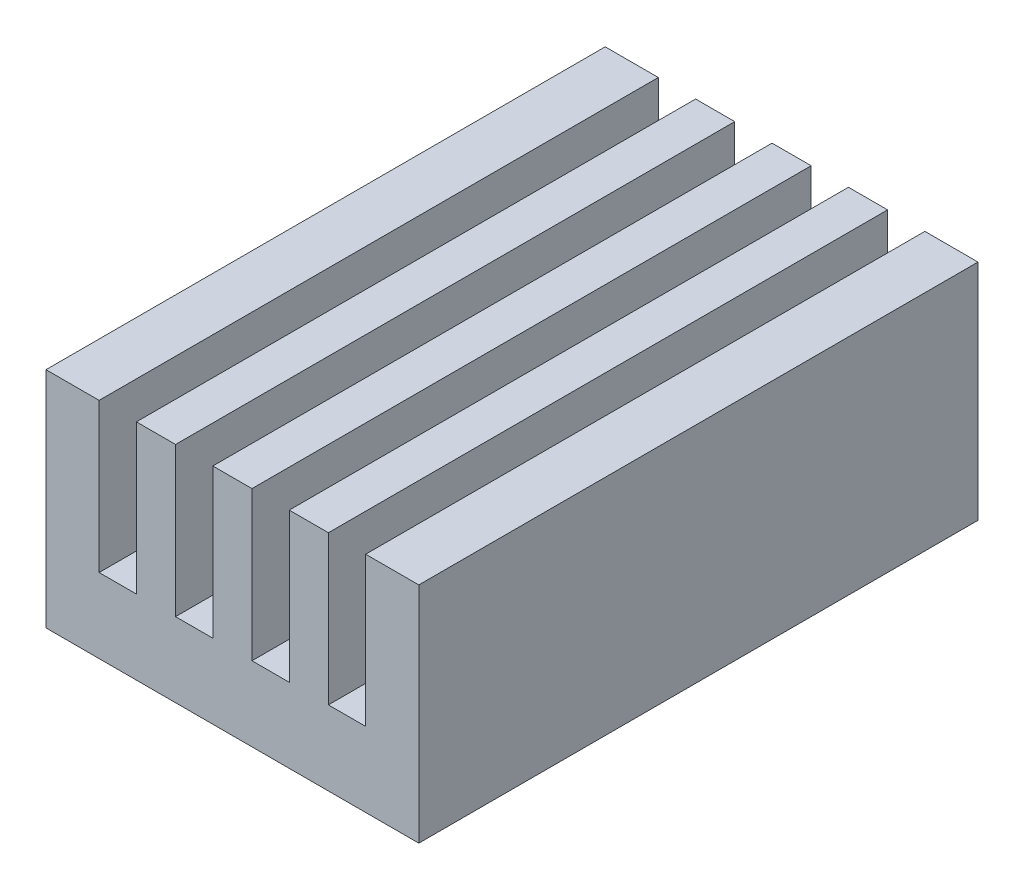
ISO-10303-21;
HEADER;
FILE_DESCRIPTION(('STEP AP214'),'2;1');
FILE_NAME('part.step','',(''),(''),'','','');
FILE_SCHEMA(('AUTOMOTIVE_DESIGN { 1 0 10303 214 1 1 1 1 }'));
ENDSEC;
DATA;
#1=APPLICATION_CONTEXT('core data for automotive mechanical design processes');
#2=APPLICATION_PROTOCOL_DEFINITION('international standard','automotive_design',2000,#1);
#3=PRODUCT_CONTEXT('',#1,'mechanical');
#4=PRODUCT('Part','Part','',(#3));
#5=PRODUCT_RELATED_PRODUCT_CATEGORY('part','',(#4));
#6=PRODUCT_DEFINITION_FORMATION('','',#4);
#7=PRODUCT_DEFINITION_CONTEXT('part definition',#1,'design');
#8=PRODUCT_DEFINITION('design','',#6,#7);
#9=PRODUCT_DEFINITION_SHAPE('','',#8);
#10=(LENGTH_UNIT() NAMED_UNIT(*) SI_UNIT(.MILLI.,.METRE.));
#11=(NAMED_UNIT(*) PLANE_ANGLE_UNIT() SI_UNIT($,.RADIAN.));
#12=(NAMED_UNIT(*) SI_UNIT($,.STERADIAN.) SOLID_ANGLE_UNIT());
#13=UNCERTAINTY_MEASURE_WITH_UNIT(LENGTH_MEASURE(1.E-05),#10,'distance_accuracy_value','');
#14=(GEOMETRIC_REPRESENTATION_CONTEXT(3) GLOBAL_UNCERTAINTY_ASSIGNED_CONTEXT((#13)) GLOBAL_UNIT_ASSIGNED_CONTEXT((#10,
#11,#12)) REPRESENTATION_CONTEXT('',''));
#15=CARTESIAN_POINT('',(0.,0.,0.));
#16=DIRECTION('',(0.,0.,1.));
#17=DIRECTION('',(1.,0.,0.));
#18=AXIS2_PLACEMENT_3D('',#15,#16,#17);
#19=CARTESIAN_POINT('',(-3.575,0.,15.));
#20=DIRECTION('',(1.,0.,0.));
#21=DIRECTION('',(0.,0.,-1.));
#22=AXIS2_PLACEMENT_3D('',#19,#20,#21);
#23=PLANE('',#22);
#24=DIRECTION('',(0.,-1.,0.));
#25=VECTOR('',#24,1.);
#26=CARTESIAN_POINT('',(-3.575,0.,0.));
#27=LINE('',#26,#25);
#28=CARTESIAN_POINT('',(-3.575,6.,0.));
#29=VERTEX_POINT('',#28);
#30=CARTESIAN_POINT('',(-3.575,2.,0.));
#31=VERTEX_POINT('',#30);
#32=EDGE_CURVE('E248',#29,#31,#27,.T.);
#33=ORIENTED_EDGE('',*,*,#32,.F.);
#34=DIRECTION('',(0.,0.,-1.));
#35=VECTOR('',#34,1.);
#36=CARTESIAN_POINT('',(-3.575,6.,15.));
#37=LINE('',#36,#35);
#38=CARTESIAN_POINT('',(-3.575,6.,15.));
#39=VERTEX_POINT('',#38);
#40=EDGE_CURVE('E11',#39,#29,#37,.T.);
#41=ORIENTED_EDGE('',*,*,#40,.F.);
#42=DIRECTION('',(0.,-1.,0.));
#43=VECTOR('',#42,1.);
#44=CARTESIAN_POINT('',(-3.575,0.,15.));
#45=LINE('',#44,#43);
#46=CARTESIAN_POINT('',(-3.575,2.,15.));
#47=VERTEX_POINT('',#46);
#48=EDGE_CURVE('E210',#39,#47,#45,.T.);
#49=ORIENTED_EDGE('',*,*,#48,.T.);
#50=DIRECTION('',(0.,0.,-1.));
#51=VECTOR('',#50,1.);
#52=CARTESIAN_POINT('',(-3.575,2.,15.));
#53=LINE('',#52,#51);
#54=EDGE_CURVE('E124',#47,#31,#53,.T.);
#55=ORIENTED_EDGE('',*,*,#54,.T.);
#56=EDGE_LOOP('',(#33,#41,#49,#55));
#57=FACE_BOUND('',#56,.T.);
#58=ADVANCED_FACE('F37',(#57),#23,.T.);
#59=CARTESIAN_POINT('',(0.,6.,15.));
#60=DIRECTION('',(0.,1.,0.));
#61=DIRECTION('',(-1.,0.,0.));
#62=AXIS2_PLACEMENT_3D('',#59,#60,#61);
#63=PLANE('',#62);
#64=DIRECTION('',(1.,0.,0.));
#65=VECTOR('',#64,1.);
#66=CARTESIAN_POINT('',(0.,6.,0.));
#67=LINE('',#66,#65);
#68=CARTESIAN_POINT('',(-5.,6.,0.));
#69=VERTEX_POINT('',#68);
#70=EDGE_CURVE('E251',#69,#29,#67,.T.);
#71=ORIENTED_EDGE('',*,*,#70,.F.);
#72=DIRECTION('',(0.,0.,-1.));
#73=VECTOR('',#72,1.);
#74=CARTESIAN_POINT('',(-5.,6.,15.));
#75=LINE('',#74,#73);
#76=CARTESIAN_POINT('',(-5.,6.,15.));
#77=VERTEX_POINT('',#76);
#78=EDGE_CURVE('E46',#77,#69,#75,.T.);
#79=ORIENTED_EDGE('',*,*,#78,.F.);
#80=DIRECTION('',(1.,0.,0.));
#81=VECTOR('',#80,1.);
#82=CARTESIAN_POINT('',(0.,6.,15.));
#83=LINE('',#82,#81);
#84=EDGE_CURVE('E199',#77,#39,#83,.T.);
#85=ORIENTED_EDGE('',*,*,#84,.T.);
#86=ORIENTED_EDGE('',*,*,#40,.T.);
#87=EDGE_LOOP('',(#71,#79,#85,#86));
#88=FACE_BOUND('',#87,.T.);
#89=ADVANCED_FACE('F338',(#88),#63,.T.);
#90=CARTESIAN_POINT('',(-5.,0.,15.));
#91=DIRECTION('',(1.,0.,0.));
#92=DIRECTION('',(0.,1.,0.));
#93=AXIS2_PLACEMENT_3D('',#90,#91,#92);
#94=PLANE('',#93);
#95=DIRECTION('',(0.,-1.,0.));
#96=VECTOR('',#95,1.);
#97=CARTESIAN_POINT('',(-5.,0.,0.));
#98=LINE('',#97,#96);
#99=CARTESIAN_POINT('',(-5.,0.,0.));
#100=VERTEX_POINT('',#99);
#101=EDGE_CURVE('E254',#69,#100,#98,.T.);
#102=ORIENTED_EDGE('',*,*,#101,.T.);
#103=DIRECTION('',(0.,0.,-1.));
#104=VECTOR('',#103,1.);
#105=CARTESIAN_POINT('',(-5.,0.,15.));
#106=LINE('',#105,#104);
#107=CARTESIAN_POINT('',(-5.,0.,15.));
#108=VERTEX_POINT('',#107);
#109=EDGE_CURVE('E327',#108,#100,#106,.T.);
#110=ORIENTED_EDGE('',*,*,#109,.F.);
#111=DIRECTION('',(0.,-1.,0.));
#112=VECTOR('',#111,1.);
#113=CARTESIAN_POINT('',(-5.,0.,15.));
#114=LINE('',#113,#112);
#115=EDGE_CURVE('E209',#77,#108,#114,.T.);
#116=ORIENTED_EDGE('',*,*,#115,.F.);
#117=ORIENTED_EDGE('',*,*,#78,.T.);
#118=EDGE_LOOP('',(#102,#110,#116,#117));
#119=FACE_BOUND('',#118,.T.);
#120=ADVANCED_FACE('F332',(#119),#94,.F.);
#121=CARTESIAN_POINT('',(0.,0.,15.));
#122=DIRECTION('',(0.,1.,0.));
#123=DIRECTION('',(-1.,0.,0.));
#124=AXIS2_PLACEMENT_3D('',#121,#122,#123);
#125=PLANE('',#124);
#126=DIRECTION('',(1.,0.,0.));
#127=VECTOR('',#126,1.);
#128=CARTESIAN_POINT('',(0.,0.,0.));
#129=LINE('',#128,#127);
#130=CARTESIAN_POINT('',(5.,0.,0.));
#131=VERTEX_POINT('',#130);
#132=EDGE_CURVE('E257',#100,#131,#129,.T.);
#133=ORIENTED_EDGE('',*,*,#132,.T.);
#134=DIRECTION('',(0.,0.,-1.));
#135=VECTOR('',#134,1.);
#136=CARTESIAN_POINT('',(5.,0.,15.));
#137=LINE('',#136,#135);
#138=CARTESIAN_POINT('',(5.,0.,15.));
#139=VERTEX_POINT('',#138);
#140=EDGE_CURVE('E325',#139,#131,#137,.T.);
#141=ORIENTED_EDGE('',*,*,#140,.F.);
#142=DIRECTION('',(1.,0.,0.));
#143=VECTOR('',#142,1.);
#144=CARTESIAN_POINT('',(0.,0.,15.));
#145=LINE('',#144,#143);
#146=EDGE_CURVE('E214',#108,#139,#145,.T.);
#147=ORIENTED_EDGE('',*,*,#146,.F.);
#148=ORIENTED_EDGE('',*,*,#109,.T.);
#149=EDGE_LOOP('',(#133,#141,#147,#148));
#150=FACE_BOUND('',#149,.T.);
#151=ADVANCED_FACE('F346',(#150),#125,.F.);
#152=CARTESIAN_POINT('',(5.,0.,15.));
#153=DIRECTION('',(1.,0.,0.));
#154=DIRECTION('',(0.,1.,0.));
#155=AXIS2_PLACEMENT_3D('',#152,#153,#154);
#156=PLANE('',#155);
#157=DIRECTION('',(0.,-1.,0.));
#158=VECTOR('',#157,1.);
#159=CARTESIAN_POINT('',(5.,0.,0.));
#160=LINE('',#159,#158);
#161=CARTESIAN_POINT('',(5.,6.,0.));
#162=VERTEX_POINT('',#161);
#163=EDGE_CURVE('E260',#162,#131,#160,.T.);
#164=ORIENTED_EDGE('',*,*,#163,.F.);
#165=DIRECTION('',(0.,0.,-1.));
#166=VECTOR('',#165,1.);
#167=CARTESIAN_POINT('',(5.,6.,15.));
#168=LINE('',#167,#166);
#169=CARTESIAN_POINT('',(5.,6.,15.));
#170=VERTEX_POINT('',#169);
#171=EDGE_CURVE('E323',#170,#162,#168,.T.);
#172=ORIENTED_EDGE('',*,*,#171,.F.);
#173=DIRECTION('',(0.,-1.,0.));
#174=VECTOR('',#173,1.);
#175=CARTESIAN_POINT('',(5.,0.,15.));
#176=LINE('',#175,#174);
#177=EDGE_CURVE('E218',#170,#139,#176,.T.);
#178=ORIENTED_EDGE('',*,*,#177,.T.);
#179=ORIENTED_EDGE('',*,*,#140,.T.);
#180=EDGE_LOOP('',(#164,#172,#178,#179));
#181=FACE_BOUND('',#180,.T.);
#182=ADVANCED_FACE('F370',(#181),#156,.T.);
#183=CARTESIAN_POINT('',(3.575,6.,0.));
#184=VERTEX_POINT('',#183);
#185=EDGE_CURVE('E255',#184,#162,#67,.T.);
#186=ORIENTED_EDGE('',*,*,#185,.F.);
#187=DIRECTION('',(0.,0.,-1.));
#188=VECTOR('',#187,1.);
#189=CARTESIAN_POINT('',(3.575,6.,15.));
#190=LINE('',#189,#188);
#191=CARTESIAN_POINT('',(3.575,6.,15.));
#192=VERTEX_POINT('',#191);
#193=EDGE_CURVE('E321',#192,#184,#190,.T.);
#194=ORIENTED_EDGE('',*,*,#193,.F.);
#195=EDGE_CURVE('E211',#192,#170,#83,.T.);
#196=ORIENTED_EDGE('',*,*,#195,.T.);
#197=ORIENTED_EDGE('',*,*,#171,.T.);
#198=EDGE_LOOP('',(#186,#194,#196,#197));
#199=FACE_BOUND('',#198,.T.);
#200=ADVANCED_FACE('F384',(#199),#63,.T.);
#201=CARTESIAN_POINT('',(3.575,0.,15.));
#202=DIRECTION('',(1.,0.,0.));
#203=DIRECTION('',(0.,0.,-1.));
#204=AXIS2_PLACEMENT_3D('',#201,#202,#203);
#205=PLANE('',#204);
#206=DIRECTION('',(0.,-1.,0.));
#207=VECTOR('',#206,1.);
#208=CARTESIAN_POINT('',(3.575,0.,0.));
#209=LINE('',#208,#207);
#210=CARTESIAN_POINT('',(3.575,2.,0.));
#211=VERTEX_POINT('',#210);
#212=EDGE_CURVE('E264',#184,#211,#209,.T.);
#213=ORIENTED_EDGE('',*,*,#212,.T.);
#214=DIRECTION('',(0.,0.,-1.));
#215=VECTOR('',#214,1.);
#216=CARTESIAN_POINT('',(3.575,2.,15.));
#217=LINE('',#216,#215);
#218=CARTESIAN_POINT('',(3.575,2.,15.));
#219=VERTEX_POINT('',#218);
#220=EDGE_CURVE('E318',#219,#211,#217,.T.);
#221=ORIENTED_EDGE('',*,*,#220,.F.);
#222=DIRECTION('',(0.,-1.,0.));
#223=VECTOR('',#222,1.);
#224=CARTESIAN_POINT('',(3.575,0.,15.));
#225=LINE('',#224,#223);
#226=EDGE_CURVE('E217',#192,#219,#225,.T.);
#227=ORIENTED_EDGE('',*,*,#226,.F.);
#228=ORIENTED_EDGE('',*,*,#193,.T.);
#229=EDGE_LOOP('',(#213,#221,#227,#228));
#230=FACE_BOUND('',#229,.T.);
#231=ADVANCED_FACE('F392',(#230),#205,.F.);
#232=CARTESIAN_POINT('',(0.,2.,15.));
#233=DIRECTION('',(0.,1.,0.));
#234=DIRECTION('',(0.,0.,1.));
#235=AXIS2_PLACEMENT_3D('',#232,#233,#234);
#236=PLANE('',#235);
#237=DIRECTION('',(1.,0.,0.));
#238=VECTOR('',#237,1.);
#239=CARTESIAN_POINT('',(0.,2.,0.));
#240=LINE('',#239,#238);
#241=CARTESIAN_POINT('',(2.575,2.,0.));
#242=VERTEX_POINT('',#241);
#243=EDGE_CURVE('E267',#242,#211,#240,.T.);
#244=ORIENTED_EDGE('',*,*,#243,.F.);
#245=DIRECTION('',(0.,0.,-1.));
#246=VECTOR('',#245,1.);
#247=CARTESIAN_POINT('',(2.575,2.,15.));
#248=LINE('',#247,#246);
#249=CARTESIAN_POINT('',(2.575,2.,15.));
#250=VERTEX_POINT('',#249);
#251=EDGE_CURVE('E316',#250,#242,#248,.T.);
#252=ORIENTED_EDGE('',*,*,#251,.F.);
#253=DIRECTION('',(1.,0.,0.));
#254=VECTOR('',#253,1.);
#255=CARTESIAN_POINT('',(0.,2.,15.));
#256=LINE('',#255,#254);
#257=EDGE_CURVE('E221',#250,#219,#256,.T.);
#258=ORIENTED_EDGE('',*,*,#257,.T.);
#259=ORIENTED_EDGE('',*,*,#220,.T.);
#260=EDGE_LOOP('',(#244,#252,#258,#259));
#261=FACE_BOUND('',#260,.T.);
#262=ADVANCED_FACE('F400',(#261),#236,.T.);
#263=CARTESIAN_POINT('',(2.575,0.,15.));
#264=DIRECTION('',(1.,0.,0.));
#265=DIRECTION('',(0.,0.,-1.));
#266=AXIS2_PLACEMENT_3D('',#263,#264,#265);
#267=PLANE('',#266);
#268=DIRECTION('',(0.,-1.,0.));
#269=VECTOR('',#268,1.);
#270=CARTESIAN_POINT('',(2.575,0.,0.));
#271=LINE('',#270,#269);
#272=CARTESIAN_POINT('',(2.575,6.,0.));
#273=VERTEX_POINT('',#272);
#274=EDGE_CURVE('E270',#273,#242,#271,.T.);
#275=ORIENTED_EDGE('',*,*,#274,.F.);
#276=DIRECTION('',(0.,0.,-1.));
#277=VECTOR('',#276,1.);
#278=CARTESIAN_POINT('',(2.575,6.,15.));
#279=LINE('',#278,#277);
#280=CARTESIAN_POINT('',(2.575,6.,15.));
#281=VERTEX_POINT('',#280);
#282=EDGE_CURVE('E314',#281,#273,#279,.T.);
#283=ORIENTED_EDGE('',*,*,#282,.F.);
#284=DIRECTION('',(0.,-1.,0.));
#285=VECTOR('',#284,1.);
#286=CARTESIAN_POINT('',(2.575,0.,15.));
#287=LINE('',#286,#285);
#288=EDGE_CURVE('E227',#281,#250,#287,.T.);
#289=ORIENTED_EDGE('',*,*,#288,.T.);
#290=ORIENTED_EDGE('',*,*,#251,.T.);
#291=EDGE_LOOP('',(#275,#283,#289,#290));
#292=FACE_BOUND('',#291,.T.);
#293=ADVANCED_FACE('F408',(#292),#267,.T.);
#294=CARTESIAN_POINT('',(1.525,6.,0.));
#295=VERTEX_POINT('',#294);
#296=EDGE_CURVE('E274',#295,#273,#67,.T.);
#297=ORIENTED_EDGE('',*,*,#296,.F.);
#298=DIRECTION('',(0.,0.,-1.));
#299=VECTOR('',#298,1.);
#300=CARTESIAN_POINT('',(1.525,6.,15.));
#301=LINE('',#300,#299);
#302=CARTESIAN_POINT('',(1.525,6.,15.));
#303=VERTEX_POINT('',#302);
#304=EDGE_CURVE('E312',#303,#295,#301,.T.);
#305=ORIENTED_EDGE('',*,*,#304,.F.);
#306=EDGE_CURVE('E207',#303,#281,#83,.T.);
#307=ORIENTED_EDGE('',*,*,#306,.T.);
#308=ORIENTED_EDGE('',*,*,#282,.T.);
#309=EDGE_LOOP('',(#297,#305,#307,#308));
#310=FACE_BOUND('',#309,.T.);
#311=ADVANCED_FACE('F394',(#310),#63,.T.);
#312=CARTESIAN_POINT('',(1.525,0.,15.));
#313=DIRECTION('',(1.,0.,0.));
#314=DIRECTION('',(0.,1.,0.));
#315=AXIS2_PLACEMENT_3D('',#312,#313,#314);
#316=PLANE('',#315);
#317=DIRECTION('',(0.,-1.,0.));
#318=VECTOR('',#317,1.);
#319=CARTESIAN_POINT('',(1.525,0.,0.));
#320=LINE('',#319,#318);
#321=CARTESIAN_POINT('',(1.525,2.,0.));
#322=VERTEX_POINT('',#321);
#323=EDGE_CURVE('E275',#295,#322,#320,.T.);
#324=ORIENTED_EDGE('',*,*,#323,.T.);
#325=DIRECTION('',(0.,0.,-1.));
#326=VECTOR('',#325,1.);
#327=CARTESIAN_POINT('',(1.525,2.,15.));
#328=LINE('',#327,#326);
#329=CARTESIAN_POINT('',(1.525,2.,15.));
#330=VERTEX_POINT('',#329);
#331=EDGE_CURVE('E309',#330,#322,#328,.T.);
#332=ORIENTED_EDGE('',*,*,#331,.F.);
#333=DIRECTION('',(0.,-1.,0.));
#334=VECTOR('',#333,1.);
#335=CARTESIAN_POINT('',(1.525,0.,15.));
#336=LINE('',#335,#334);
#337=EDGE_CURVE('E226',#303,#330,#336,.T.);
#338=ORIENTED_EDGE('',*,*,#337,.F.);
#339=ORIENTED_EDGE('',*,*,#304,.T.);
#340=EDGE_LOOP('',(#324,#332,#338,#339));
#341=FACE_BOUND('',#340,.T.);
#342=ADVANCED_FACE('F422',(#341),#316,.F.);
#343=CARTESIAN_POINT('',(0.,2.,15.));
#344=DIRECTION('',(0.,1.,0.));
#345=DIRECTION('',(0.,0.,1.));
#346=AXIS2_PLACEMENT_3D('',#343,#344,#345);
#347=PLANE('',#346);
#348=DIRECTION('',(1.,0.,0.));
#349=VECTOR('',#348,1.);
#350=CARTESIAN_POINT('',(0.,2.,0.));
#351=LINE('',#350,#349);
#352=CARTESIAN_POINT('',(0.525000000000001,2.,0.));
#353=VERTEX_POINT('',#352);
#354=EDGE_CURVE('E278',#353,#322,#351,.T.);
#355=ORIENTED_EDGE('',*,*,#354,.F.);
#356=DIRECTION('',(0.,0.,-1.));
#357=VECTOR('',#356,1.);
#358=CARTESIAN_POINT('',(0.525000000000001,2.,15.));
#359=LINE('',#358,#357);
#360=CARTESIAN_POINT('',(0.525000000000001,2.,15.));
#361=VERTEX_POINT('',#360);
#362=EDGE_CURVE('E307',#361,#353,#359,.T.);
#363=ORIENTED_EDGE('',*,*,#362,.F.);
#364=DIRECTION('',(1.,0.,0.));
#365=VECTOR('',#364,1.);
#366=CARTESIAN_POINT('',(0.,2.,15.));
#367=LINE('',#366,#365);
#368=EDGE_CURVE('E230',#361,#330,#367,.T.);
#369=ORIENTED_EDGE('',*,*,#368,.T.);
#370=ORIENTED_EDGE('',*,*,#331,.T.);
#371=EDGE_LOOP('',(#355,#363,#369,#370));
#372=FACE_BOUND('',#371,.T.);
#373=ADVANCED_FACE('F429',(#372),#347,.T.);
#374=CARTESIAN_POINT('',(0.525000000000001,0.,15.));
#375=DIRECTION('',(1.,0.,0.));
#376=DIRECTION('',(0.,0.,-1.));
#377=AXIS2_PLACEMENT_3D('',#374,#375,#376);
#378=PLANE('',#377);
#379=DIRECTION('',(0.,-1.,0.));
#380=VECTOR('',#379,1.);
#381=CARTESIAN_POINT('',(0.525000000000001,0.,0.));
#382=LINE('',#381,#380);
#383=CARTESIAN_POINT('',(0.525000000000001,6.,0.));
#384=VERTEX_POINT('',#383);
#385=EDGE_CURVE('E281',#384,#353,#382,.T.);
#386=ORIENTED_EDGE('',*,*,#385,.F.);
#387=DIRECTION('',(0.,0.,-1.));
#388=VECTOR('',#387,1.);
#389=CARTESIAN_POINT('',(0.525000000000001,6.,15.));
#390=LINE('',#389,#388);
#391=CARTESIAN_POINT('',(0.525000000000001,6.,15.));
#392=VERTEX_POINT('',#391);
#393=EDGE_CURVE('E305',#392,#384,#390,.T.);
#394=ORIENTED_EDGE('',*,*,#393,.F.);
#395=DIRECTION('',(0.,-1.,0.));
#396=VECTOR('',#395,1.);
#397=CARTESIAN_POINT('',(0.525000000000001,0.,15.));
#398=LINE('',#397,#396);
#399=EDGE_CURVE('E206',#392,#361,#398,.T.);
#400=ORIENTED_EDGE('',*,*,#399,.T.);
#401=ORIENTED_EDGE('',*,*,#362,.T.);
#402=EDGE_LOOP('',(#386,#394,#400,#401));
#403=FACE_BOUND('',#402,.T.);
#404=ADVANCED_FACE('F437',(#403),#378,.T.);
#405=CARTESIAN_POINT('',(-0.525,6.,0.));
#406=VERTEX_POINT('',#405);
#407=EDGE_CURVE('E284',#406,#384,#67,.T.);
#408=ORIENTED_EDGE('',*,*,#407,.F.);
#409=DIRECTION('',(0.,0.,-1.));
#410=VECTOR('',#409,1.);
#411=CARTESIAN_POINT('',(-0.525,6.,15.));
#412=LINE('',#411,#410);
#413=CARTESIAN_POINT('',(-0.525,6.,15.));
#414=VERTEX_POINT('',#413);
#415=EDGE_CURVE('E303',#414,#406,#412,.T.);
#416=ORIENTED_EDGE('',*,*,#415,.F.);
#417=EDGE_CURVE('E198',#414,#392,#83,.T.);
#418=ORIENTED_EDGE('',*,*,#417,.T.);
#419=ORIENTED_EDGE('',*,*,#393,.T.);
#420=EDGE_LOOP('',(#408,#416,#418,#419));
#421=FACE_BOUND('',#420,.T.);
#422=ADVANCED_FACE('F423',(#421),#63,.T.);
#423=CARTESIAN_POINT('',(-0.525,0.,15.));
#424=DIRECTION('',(1.,0.,0.));
#425=DIRECTION('',(0.,0.,-1.));
#426=AXIS2_PLACEMENT_3D('',#423,#424,#425);
#427=PLANE('',#426);
#428=DIRECTION('',(0.,-1.,0.));
#429=VECTOR('',#428,1.);
#430=CARTESIAN_POINT('',(-0.525,0.,0.));
#431=LINE('',#430,#429);
#432=CARTESIAN_POINT('',(-0.525,2.,0.));
#433=VERTEX_POINT('',#432);
#434=EDGE_CURVE('E285',#406,#433,#431,.T.);
#435=ORIENTED_EDGE('',*,*,#434,.T.);
#436=DIRECTION('',(0.,0.,-1.));
#437=VECTOR('',#436,1.);
#438=CARTESIAN_POINT('',(-0.525,2.,15.));
#439=LINE('',#438,#437);
#440=CARTESIAN_POINT('',(-0.525,2.,15.));
#441=VERTEX_POINT('',#440);
#442=EDGE_CURVE('E300',#441,#433,#439,.T.);
#443=ORIENTED_EDGE('',*,*,#442,.F.);
#444=DIRECTION('',(0.,-1.,0.));
#445=VECTOR('',#444,1.);
#446=CARTESIAN_POINT('',(-0.525,0.,15.));
#447=LINE('',#446,#445);
#448=EDGE_CURVE('E205',#414,#441,#447,.T.);
#449=ORIENTED_EDGE('',*,*,#448,.F.);
#450=ORIENTED_EDGE('',*,*,#415,.T.);
#451=EDGE_LOOP('',(#435,#443,#449,#450));
#452=FACE_BOUND('',#451,.T.);
#453=ADVANCED_FACE('F452',(#452),#427,.F.);
#454=CARTESIAN_POINT('',(0.,2.,15.));
#455=DIRECTION('',(0.,-1.,0.));
#456=DIRECTION('',(1.,0.,0.));
#457=AXIS2_PLACEMENT_3D('',#454,#455,#456);
#458=PLANE('',#457);
#459=DIRECTION('',(-1.,0.,0.));
#460=VECTOR('',#459,1.);
#461=CARTESIAN_POINT('',(0.,2.,0.));
#462=LINE('',#461,#460);
#463=CARTESIAN_POINT('',(-1.525,2.,0.));
#464=VERTEX_POINT('',#463);
#465=EDGE_CURVE('E287',#433,#464,#462,.T.);
#466=ORIENTED_EDGE('',*,*,#465,.T.);
#467=DIRECTION('',(0.,0.,-1.));
#468=VECTOR('',#467,1.);
#469=CARTESIAN_POINT('',(-1.525,2.,15.));
#470=LINE('',#469,#468);
#471=CARTESIAN_POINT('',(-1.525,2.,15.));
#472=VERTEX_POINT('',#471);
#473=EDGE_CURVE('E298',#472,#464,#470,.T.);
#474=ORIENTED_EDGE('',*,*,#473,.F.);
#475=DIRECTION('',(-1.,0.,0.));
#476=VECTOR('',#475,1.);
#477=CARTESIAN_POINT('',(0.,2.,15.));
#478=LINE('',#477,#476);
#479=EDGE_CURVE('E200',#441,#472,#478,.T.);
#480=ORIENTED_EDGE('',*,*,#479,.F.);
#481=ORIENTED_EDGE('',*,*,#442,.T.);
#482=EDGE_LOOP('',(#466,#474,#480,#481));
#483=FACE_BOUND('',#482,.T.);
#484=ADVANCED_FACE('F459',(#483),#458,.F.);
#485=CARTESIAN_POINT('',(-1.525,0.,15.));
#486=DIRECTION('',(1.,0.,0.));
#487=DIRECTION('',(0.,1.,0.));
#488=AXIS2_PLACEMENT_3D('',#485,#486,#487);
#489=PLANE('',#488);
#490=DIRECTION('',(0.,-1.,0.));
#491=VECTOR('',#490,1.);
#492=CARTESIAN_POINT('',(-1.525,0.,0.));
#493=LINE('',#492,#491);
#494=CARTESIAN_POINT('',(-1.525,6.,0.));
#495=VERTEX_POINT('',#494);
#496=EDGE_CURVE('E290',#495,#464,#493,.T.);
#497=ORIENTED_EDGE('',*,*,#496,.F.);
#498=DIRECTION('',(0.,0.,-1.));
#499=VECTOR('',#498,1.);
#500=CARTESIAN_POINT('',(-1.525,6.,15.));
#501=LINE('',#500,#499);
#502=CARTESIAN_POINT('',(-1.525,6.,15.));
#503=VERTEX_POINT('',#502);
#504=EDGE_CURVE('E187',#503,#495,#501,.T.);
#505=ORIENTED_EDGE('',*,*,#504,.F.);
#506=DIRECTION('',(0.,-1.,0.));
#507=VECTOR('',#506,1.);
#508=CARTESIAN_POINT('',(-1.525,0.,15.));
#509=LINE('',#508,#507);
#510=EDGE_CURVE('E196',#503,#472,#509,.T.);
#511=ORIENTED_EDGE('',*,*,#510,.T.);
#512=ORIENTED_EDGE('',*,*,#473,.T.);
#513=EDGE_LOOP('',(#497,#505,#511,#512));
#514=FACE_BOUND('',#513,.T.);
#515=ADVANCED_FACE('F467',(#514),#489,.T.);
#516=CARTESIAN_POINT('',(-2.575,6.,0.));
#517=VERTEX_POINT('',#516);
#518=EDGE_CURVE('E186',#517,#495,#67,.T.);
#519=ORIENTED_EDGE('',*,*,#518,.F.);
#520=DIRECTION('',(0.,0.,-1.));
#521=VECTOR('',#520,1.);
#522=CARTESIAN_POINT('',(-2.575,6.,15.));
#523=LINE('',#522,#521);
#524=CARTESIAN_POINT('',(-2.575,6.,15.));
#525=VERTEX_POINT('',#524);
#526=EDGE_CURVE('E180',#525,#517,#523,.T.);
#527=ORIENTED_EDGE('',*,*,#526,.F.);
#528=EDGE_CURVE('E184',#525,#503,#83,.T.);
#529=ORIENTED_EDGE('',*,*,#528,.T.);
#530=ORIENTED_EDGE('',*,*,#504,.T.);
#531=EDGE_LOOP('',(#519,#527,#529,#530));
#532=FACE_BOUND('',#531,.T.);
#533=ADVANCED_FACE('F182',(#532),#63,.T.);
#534=CARTESIAN_POINT('',(-2.575,0.,15.));
#535=DIRECTION('',(1.,0.,0.));
#536=DIRECTION('',(0.,0.,-1.));
#537=AXIS2_PLACEMENT_3D('',#534,#535,#536);
#538=PLANE('',#537);
#539=DIRECTION('',(0.,-1.,0.));
#540=VECTOR('',#539,1.);
#541=CARTESIAN_POINT('',(-2.575,0.,0.));
#542=LINE('',#541,#540);
#543=CARTESIAN_POINT('',(-2.575,2.,0.));
#544=VERTEX_POINT('',#543);
#545=EDGE_CURVE('E117',#517,#544,#542,.T.);
#546=ORIENTED_EDGE('',*,*,#545,.T.);
#547=DIRECTION('',(0.,0.,-1.));
#548=VECTOR('',#547,1.);
#549=CARTESIAN_POINT('',(-2.575,2.,15.));
#550=LINE('',#549,#548);
#551=CARTESIAN_POINT('',(-2.575,2.,15.));
#552=VERTEX_POINT('',#551);
#553=EDGE_CURVE('E188',#552,#544,#550,.T.);
#554=ORIENTED_EDGE('',*,*,#553,.F.);
#555=DIRECTION('',(0.,-1.,0.));
#556=VECTOR('',#555,1.);
#557=CARTESIAN_POINT('',(-2.575,0.,15.));
#558=LINE('',#557,#556);
#559=EDGE_CURVE('E190',#525,#552,#558,.T.);
#560=ORIENTED_EDGE('',*,*,#559,.F.);
#561=ORIENTED_EDGE('',*,*,#526,.T.);
#562=EDGE_LOOP('',(#546,#554,#560,#561));
#563=FACE_BOUND('',#562,.T.);
#564=ADVANCED_FACE('F191',(#563),#538,.F.);
#565=CARTESIAN_POINT('',(0.,2.,15.));
#566=DIRECTION('',(0.,-1.,0.));
#567=DIRECTION('',(1.,0.,0.));
#568=AXIS2_PLACEMENT_3D('',#565,#566,#567);
#569=PLANE('',#568);
#570=DIRECTION('',(-1.,0.,0.));
#571=VECTOR('',#570,1.);
#572=CARTESIAN_POINT('',(0.,2.,0.));
#573=LINE('',#572,#571);
#574=EDGE_CURVE('E215',#544,#31,#573,.T.);
#575=ORIENTED_EDGE('',*,*,#574,.T.);
#576=ORIENTED_EDGE('',*,*,#54,.F.);
#577=DIRECTION('',(-1.,0.,0.));
#578=VECTOR('',#577,1.);
#579=CARTESIAN_POINT('',(0.,2.,15.));
#580=LINE('',#579,#578);
#581=EDGE_CURVE('E54',#552,#47,#580,.T.);
#582=ORIENTED_EDGE('',*,*,#581,.F.);
#583=ORIENTED_EDGE('',*,*,#553,.T.);
#584=EDGE_LOOP('',(#575,#576,#582,#583));
#585=FACE_BOUND('',#584,.T.);
#586=ADVANCED_FACE('F341',(#585),#569,.F.);
#587=CARTESIAN_POINT('',(0.,0.,15.));
#588=DIRECTION('',(0.,0.,1.));
#589=DIRECTION('',(1.,0.,0.));
#590=AXIS2_PLACEMENT_3D('',#587,#588,#589);
#591=PLANE('',#590);
#592=ORIENTED_EDGE('',*,*,#48,.F.);
#593=ORIENTED_EDGE('',*,*,#84,.F.);
#594=ORIENTED_EDGE('',*,*,#115,.T.);
#595=ORIENTED_EDGE('',*,*,#146,.T.);
#596=ORIENTED_EDGE('',*,*,#177,.F.);
#597=ORIENTED_EDGE('',*,*,#195,.F.);
#598=ORIENTED_EDGE('',*,*,#226,.T.);
#599=ORIENTED_EDGE('',*,*,#257,.F.);
#600=ORIENTED_EDGE('',*,*,#288,.F.);
#601=ORIENTED_EDGE('',*,*,#306,.F.);
#602=ORIENTED_EDGE('',*,*,#337,.T.);
#603=ORIENTED_EDGE('',*,*,#368,.F.);
#604=ORIENTED_EDGE('',*,*,#399,.F.);
#605=ORIENTED_EDGE('',*,*,#417,.F.);
#606=ORIENTED_EDGE('',*,*,#448,.T.);
#607=ORIENTED_EDGE('',*,*,#479,.T.);
#608=ORIENTED_EDGE('',*,*,#510,.F.);
#609=ORIENTED_EDGE('',*,*,#528,.F.);
#610=ORIENTED_EDGE('',*,*,#559,.T.);
#611=ORIENTED_EDGE('',*,*,#581,.T.);
#612=EDGE_LOOP('',(#592,#593,#594,#595,#596,#597,#598,#599,#600,#601,#602,#603,#604,#605,#606,
#607,#608,#609,#610,#611));
#613=FACE_BOUND('',#612,.T.);
#614=ADVANCED_FACE('F194',(#613),#591,.T.);
#615=CARTESIAN_POINT('',(0.,0.,0.));
#616=DIRECTION('',(0.,0.,1.));
#617=DIRECTION('',(1.,0.,0.));
#618=AXIS2_PLACEMENT_3D('',#615,#616,#617);
#619=PLANE('',#618);
#620=ORIENTED_EDGE('',*,*,#32,.T.);
#621=ORIENTED_EDGE('',*,*,#574,.F.);
#622=ORIENTED_EDGE('',*,*,#545,.F.);
#623=ORIENTED_EDGE('',*,*,#518,.T.);
#624=ORIENTED_EDGE('',*,*,#496,.T.);
#625=ORIENTED_EDGE('',*,*,#465,.F.);
#626=ORIENTED_EDGE('',*,*,#434,.F.);
#627=ORIENTED_EDGE('',*,*,#407,.T.);
#628=ORIENTED_EDGE('',*,*,#385,.T.);
#629=ORIENTED_EDGE('',*,*,#354,.T.);
#630=ORIENTED_EDGE('',*,*,#323,.F.);
#631=ORIENTED_EDGE('',*,*,#296,.T.);
#632=ORIENTED_EDGE('',*,*,#274,.T.);
#633=ORIENTED_EDGE('',*,*,#243,.T.);
#634=ORIENTED_EDGE('',*,*,#212,.F.);
#635=ORIENTED_EDGE('',*,*,#185,.T.);
#636=ORIENTED_EDGE('',*,*,#163,.T.);
#637=ORIENTED_EDGE('',*,*,#132,.F.);
#638=ORIENTED_EDGE('',*,*,#101,.F.);
#639=ORIENTED_EDGE('',*,*,#70,.T.);
#640=EDGE_LOOP('',(#620,#621,#622,#623,#624,#625,#626,#627,#628,#629,#630,#631,#632,#633,#634,
#635,#636,#637,#638,#639));
#641=FACE_BOUND('',#640,.T.);
#642=ADVANCED_FACE('F337',(#641),#619,.F.);
#643=CLOSED_SHELL('',(#58,#89,#120,#151,#182,#200,#231,#262,#293,#311,#342,#373,#404,#422,#453,
#484,#515,#533,#564,#586,#614,#642));
#644=MANIFOLD_SOLID_BREP('B2',#643);
#645=ADVANCED_BREP_SHAPE_REPRESENTATION('',(#18,#644),#14);
#646=SHAPE_DEFINITION_REPRESENTATION(#9,#645);
ENDSEC;
END-ISO-10303-21;
